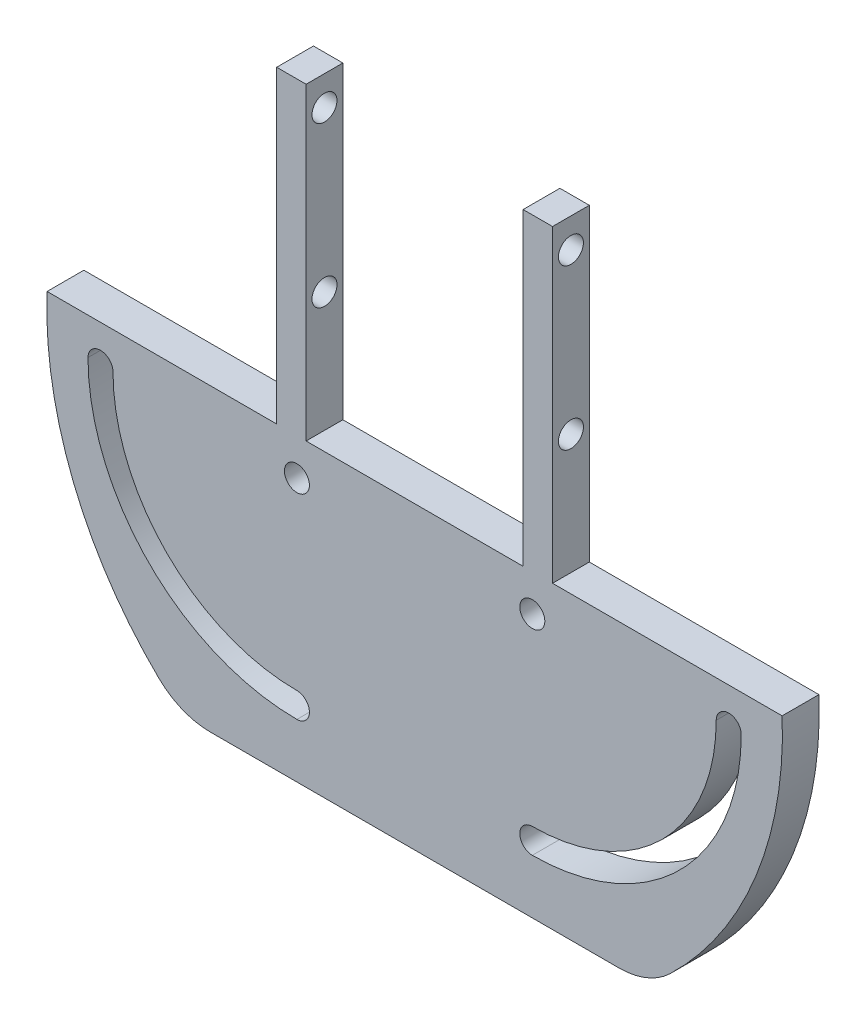
ISO-10303-21;
HEADER;
FILE_DESCRIPTION(('STEP AP214'),'2;1');
FILE_NAME('part.step','',(''),(''),'','','');
FILE_SCHEMA(('AUTOMOTIVE_DESIGN { 1 0 10303 214 1 1 1 1 }'));
ENDSEC;
DATA;
#1=APPLICATION_CONTEXT('core data for automotive mechanical design processes');
#2=APPLICATION_PROTOCOL_DEFINITION('international standard','automotive_design',2000,#1);
#3=PRODUCT_CONTEXT('',#1,'mechanical');
#4=PRODUCT('Part','Part','',(#3));
#5=PRODUCT_RELATED_PRODUCT_CATEGORY('part','',(#4));
#6=PRODUCT_DEFINITION_FORMATION('','',#4);
#7=PRODUCT_DEFINITION_CONTEXT('part definition',#1,'design');
#8=PRODUCT_DEFINITION('design','',#6,#7);
#9=PRODUCT_DEFINITION_SHAPE('','',#8);
#10=(LENGTH_UNIT() NAMED_UNIT(*) SI_UNIT(.MILLI.,.METRE.));
#11=(NAMED_UNIT(*) PLANE_ANGLE_UNIT() SI_UNIT($,.RADIAN.));
#12=(NAMED_UNIT(*) SI_UNIT($,.STERADIAN.) SOLID_ANGLE_UNIT());
#13=UNCERTAINTY_MEASURE_WITH_UNIT(LENGTH_MEASURE(1.E-05),#10,'distance_accuracy_value','');
#14=(GEOMETRIC_REPRESENTATION_CONTEXT(3) GLOBAL_UNCERTAINTY_ASSIGNED_CONTEXT((#13)) GLOBAL_UNIT_ASSIGNED_CONTEXT((#10,
#11,#12)) REPRESENTATION_CONTEXT('',''));
#15=CARTESIAN_POINT('',(0.,0.,0.));
#16=DIRECTION('',(0.,0.,1.));
#17=DIRECTION('',(1.,0.,0.));
#18=AXIS2_PLACEMENT_3D('',#15,#16,#17);
#19=CARTESIAN_POINT('',(-49.9599839871872,2.,-5.));
#20=DIRECTION('',(0.,1.,0.));
#21=DIRECTION('',(0.,0.,1.));
#22=AXIS2_PLACEMENT_3D('',#19,#20,#21);
#23=PLANE('',#22);
#24=DIRECTION('',(-1.,0.,0.));
#25=VECTOR('',#24,1.);
#26=CARTESIAN_POINT('',(-49.9599839871872,2.,-5.));
#27=LINE('',#26,#25);
#28=CARTESIAN_POINT('',(49.9599839871872,2.,-5.));
#29=VERTEX_POINT('',#28);
#30=CARTESIAN_POINT('',(18.75,2.,-5.00000000000001));
#31=VERTEX_POINT('',#30);
#32=EDGE_CURVE('E318',#29,#31,#27,.T.);
#33=ORIENTED_EDGE('',*,*,#32,.T.);
#34=DIRECTION('',(0.,0.,-1.));
#35=VECTOR('',#34,1.);
#36=CARTESIAN_POINT('',(18.75,2.,0.));
#37=LINE('',#36,#35);
#38=CARTESIAN_POINT('',(18.75,2.,0.));
#39=VERTEX_POINT('',#38);
#40=EDGE_CURVE('E506',#39,#31,#37,.T.);
#41=ORIENTED_EDGE('',*,*,#40,.F.);
#42=DIRECTION('',(-1.,0.,0.));
#43=VECTOR('',#42,1.);
#44=CARTESIAN_POINT('',(-49.9599839871872,2.,0.));
#45=LINE('',#44,#43);
#46=CARTESIAN_POINT('',(49.9599839871872,2.,0.));
#47=VERTEX_POINT('',#46);
#48=EDGE_CURVE('E204',#47,#39,#45,.T.);
#49=ORIENTED_EDGE('',*,*,#48,.F.);
#50=DIRECTION('',(0.,0.,1.));
#51=VECTOR('',#50,1.);
#52=CARTESIAN_POINT('',(49.9599839871872,2.,-5.));
#53=LINE('',#52,#51);
#54=EDGE_CURVE('E327',#29,#47,#53,.T.);
#55=ORIENTED_EDGE('',*,*,#54,.F.);
#56=EDGE_LOOP('',(#33,#41,#49,#55));
#57=FACE_BOUND('',#56,.T.);
#58=ADVANCED_FACE('F35',(#57),#23,.T.);
#59=CARTESIAN_POINT('',(14.75,2.,0.));
#60=VERTEX_POINT('',#59);
#61=CARTESIAN_POINT('',(-14.75,2.,0.));
#62=VERTEX_POINT('',#61);
#63=EDGE_CURVE('E332',#60,#62,#45,.T.);
#64=ORIENTED_EDGE('',*,*,#63,.F.);
#65=DIRECTION('',(0.,0.,1.));
#66=VECTOR('',#65,1.);
#67=CARTESIAN_POINT('',(14.75,2.,0.));
#68=LINE('',#67,#66);
#69=CARTESIAN_POINT('',(14.75,2.,-5.00000000000001));
#70=VERTEX_POINT('',#69);
#71=EDGE_CURVE('E199',#70,#60,#68,.T.);
#72=ORIENTED_EDGE('',*,*,#71,.F.);
#73=CARTESIAN_POINT('',(-14.75,2.,-5.));
#74=VERTEX_POINT('',#73);
#75=EDGE_CURVE('E322',#70,#74,#27,.T.);
#76=ORIENTED_EDGE('',*,*,#75,.T.);
#77=DIRECTION('',(0.,0.,-1.));
#78=VECTOR('',#77,1.);
#79=CARTESIAN_POINT('',(-14.75,2.,0.));
#80=LINE('',#79,#78);
#81=EDGE_CURVE('E205',#62,#74,#80,.T.);
#82=ORIENTED_EDGE('',*,*,#81,.F.);
#83=EDGE_LOOP('',(#64,#72,#76,#82));
#84=FACE_BOUND('',#83,.T.);
#85=ADVANCED_FACE('F387',(#84),#23,.T.);
#86=CARTESIAN_POINT('',(0.,0.,-5.));
#87=DIRECTION('',(0.,0.,1.));
#88=DIRECTION('',(1.,0.,0.));
#89=AXIS2_PLACEMENT_3D('',#86,#87,#88);
#90=CYLINDRICAL_SURFACE('',#89,50.);
#91=CARTESIAN_POINT('',(0.,0.,0.));
#92=DIRECTION('',(0.,0.,1.));
#93=DIRECTION('',(-1.,0.,0.));
#94=AXIS2_PLACEMENT_3D('',#91,#92,#93);
#95=CIRCLE('',#94,50.);
#96=CARTESIAN_POINT('',(34.732545986733,-35.967349767247,0.));
#97=VERTEX_POINT('',#96);
#98=EDGE_CURVE('E311',#97,#47,#95,.T.);
#99=ORIENTED_EDGE('',*,*,#98,.F.);
#100=DIRECTION('',(0.,0.,1.));
#101=VECTOR('',#100,1.);
#102=CARTESIAN_POINT('',(34.732545986733,-35.967349767247,-5.));
#103=LINE('',#102,#101);
#104=CARTESIAN_POINT('',(34.732545986733,-35.967349767247,-5.));
#105=VERTEX_POINT('',#104);
#106=EDGE_CURVE('E355',#97,#105,#103,.F.);
#107=ORIENTED_EDGE('',*,*,#106,.T.);
#108=CARTESIAN_POINT('',(0.,0.,-5.));
#109=DIRECTION('',(0.,0.,1.));
#110=DIRECTION('',(-1.,0.,0.));
#111=AXIS2_PLACEMENT_3D('',#108,#109,#110);
#112=CIRCLE('',#111,50.);
#113=EDGE_CURVE('E314',#105,#29,#112,.T.);
#114=ORIENTED_EDGE('',*,*,#113,.T.);
#115=ORIENTED_EDGE('',*,*,#54,.T.);
#116=EDGE_LOOP('',(#99,#107,#114,#115));
#117=FACE_BOUND('',#116,.T.);
#118=ADVANCED_FACE('F393',(#117),#90,.T.);
#119=CARTESIAN_POINT('',(-31.5687542387276,-38.7738798137976,-5.));
#120=DIRECTION('',(0.,-1.,0.));
#121=DIRECTION('',(0.,0.,-1.));
#122=AXIS2_PLACEMENT_3D('',#119,#120,#121);
#123=PLANE('',#122);
#124=DIRECTION('',(1.,0.,0.));
#125=VECTOR('',#124,1.);
#126=CARTESIAN_POINT('',(-31.5687542387276,-38.7738798137976,0.));
#127=LINE('',#126,#125);
#128=CARTESIAN_POINT('',(-27.7860367893864,-38.7738798137976,0.));
#129=VERTEX_POINT('',#128);
#130=CARTESIAN_POINT('',(27.7860367893864,-38.7738798137976,0.));
#131=VERTEX_POINT('',#130);
#132=EDGE_CURVE('E317',#129,#131,#127,.T.);
#133=ORIENTED_EDGE('',*,*,#132,.F.);
#134=DIRECTION('',(0.,0.,1.));
#135=VECTOR('',#134,1.);
#136=CARTESIAN_POINT('',(-27.7860367893864,-38.7738798137976,-5.));
#137=LINE('',#136,#135);
#138=CARTESIAN_POINT('',(-27.7860367893864,-38.7738798137976,-5.));
#139=VERTEX_POINT('',#138);
#140=EDGE_CURVE('E43',#129,#139,#137,.F.);
#141=ORIENTED_EDGE('',*,*,#140,.T.);
#142=DIRECTION('',(1.,0.,0.));
#143=VECTOR('',#142,1.);
#144=CARTESIAN_POINT('',(-31.5687542387276,-38.7738798137976,-5.));
#145=LINE('',#144,#143);
#146=CARTESIAN_POINT('',(27.7860367893864,-38.7738798137976,-5.));
#147=VERTEX_POINT('',#146);
#148=EDGE_CURVE('E325',#139,#147,#145,.T.);
#149=ORIENTED_EDGE('',*,*,#148,.T.);
#150=DIRECTION('',(0.,0.,1.));
#151=VECTOR('',#150,1.);
#152=CARTESIAN_POINT('',(27.7860367893864,-38.7738798137976,-5.));
#153=LINE('',#152,#151);
#154=EDGE_CURVE('E338',#147,#131,#153,.T.);
#155=ORIENTED_EDGE('',*,*,#154,.T.);
#156=EDGE_LOOP('',(#133,#141,#149,#155));
#157=FACE_BOUND('',#156,.T.);
#158=ADVANCED_FACE('F406',(#157),#123,.T.);
#159=CARTESIAN_POINT('',(0.,0.,-5.));
#160=DIRECTION('',(0.,0.,1.));
#161=DIRECTION('',(1.,0.,0.));
#162=AXIS2_PLACEMENT_3D('',#159,#160,#161);
#163=CYLINDRICAL_SURFACE('',#162,50.);
#164=CARTESIAN_POINT('',(0.,0.,-5.));
#165=DIRECTION('',(0.,0.,1.));
#166=DIRECTION('',(-1.,0.,0.));
#167=AXIS2_PLACEMENT_3D('',#164,#165,#166);
#168=CIRCLE('',#167,50.);
#169=CARTESIAN_POINT('',(-49.9599839871872,2.,-5.));
#170=VERTEX_POINT('',#169);
#171=CARTESIAN_POINT('',(-34.732545986733,-35.967349767247,-5.));
#172=VERTEX_POINT('',#171);
#173=EDGE_CURVE('E321',#170,#172,#168,.T.);
#174=ORIENTED_EDGE('',*,*,#173,.T.);
#175=DIRECTION('',(0.,0.,1.));
#176=VECTOR('',#175,1.);
#177=CARTESIAN_POINT('',(-34.732545986733,-35.967349767247,-5.));
#178=LINE('',#177,#176);
#179=CARTESIAN_POINT('',(-34.732545986733,-35.967349767247,0.));
#180=VERTEX_POINT('',#179);
#181=EDGE_CURVE('E360',#172,#180,#178,.T.);
#182=ORIENTED_EDGE('',*,*,#181,.T.);
#183=CARTESIAN_POINT('',(0.,0.,0.));
#184=DIRECTION('',(0.,0.,1.));
#185=DIRECTION('',(-1.,0.,0.));
#186=AXIS2_PLACEMENT_3D('',#183,#184,#185);
#187=CIRCLE('',#186,50.);
#188=CARTESIAN_POINT('',(-49.9599839871872,2.,0.));
#189=VERTEX_POINT('',#188);
#190=EDGE_CURVE('E331',#189,#180,#187,.T.);
#191=ORIENTED_EDGE('',*,*,#190,.F.);
#192=DIRECTION('',(0.,0.,1.));
#193=VECTOR('',#192,1.);
#194=CARTESIAN_POINT('',(-49.9599839871872,2.,-5.));
#195=LINE('',#194,#193);
#196=EDGE_CURVE('E335',#170,#189,#195,.T.);
#197=ORIENTED_EDGE('',*,*,#196,.F.);
#198=EDGE_LOOP('',(#174,#182,#191,#197));
#199=FACE_BOUND('',#198,.T.);
#200=ADVANCED_FACE('F366',(#199),#163,.T.);
#201=DIRECTION('',(0.,0.,1.));
#202=VECTOR('',#201,1.);
#203=CARTESIAN_POINT('',(-18.75,2.,0.));
#204=LINE('',#203,#202);
#205=CARTESIAN_POINT('',(-18.75,2.,-5.));
#206=VERTEX_POINT('',#205);
#207=CARTESIAN_POINT('',(-18.75,2.,0.));
#208=VERTEX_POINT('',#207);
#209=EDGE_CURVE('E208',#206,#208,#204,.T.);
#210=ORIENTED_EDGE('',*,*,#209,.F.);
#211=EDGE_CURVE('E316',#206,#170,#27,.T.);
#212=ORIENTED_EDGE('',*,*,#211,.T.);
#213=ORIENTED_EDGE('',*,*,#196,.T.);
#214=EDGE_CURVE('E329',#208,#189,#45,.T.);
#215=ORIENTED_EDGE('',*,*,#214,.F.);
#216=EDGE_LOOP('',(#210,#212,#213,#215));
#217=FACE_BOUND('',#216,.T.);
#218=ADVANCED_FACE('F374',(#217),#23,.T.);
#219=CARTESIAN_POINT('',(0.,0.,-5.));
#220=DIRECTION('',(0.,0.,-1.));
#221=DIRECTION('',(-1.,0.,0.));
#222=AXIS2_PLACEMENT_3D('',#219,#220,#221);
#223=PLANE('',#222);
#224=CARTESIAN_POINT('',(16.,-29.7,-5.));
#225=DIRECTION('',(0.,0.,1.));
#226=DIRECTION('',(1.,0.,0.));
#227=AXIS2_PLACEMENT_3D('',#224,#225,#226);
#228=CIRCLE('',#227,1.7);
#229=CARTESIAN_POINT('',(16.,-28.,-5.));
#230=VERTEX_POINT('',#229);
#231=CARTESIAN_POINT('',(16.,-31.4,-5.));
#232=VERTEX_POINT('',#231);
#233=EDGE_CURVE('E238',#230,#232,#228,.T.);
#234=ORIENTED_EDGE('',*,*,#233,.T.);
#235=CARTESIAN_POINT('',(16.,-3.,-5.));
#236=DIRECTION('',(0.,0.,1.));
#237=DIRECTION('',(1.,0.,0.));
#238=AXIS2_PLACEMENT_3D('',#235,#236,#237);
#239=CIRCLE('',#238,28.4);
#240=CARTESIAN_POINT('',(44.4,-3.,-5.));
#241=VERTEX_POINT('',#240);
#242=EDGE_CURVE('E241',#232,#241,#239,.T.);
#243=ORIENTED_EDGE('',*,*,#242,.T.);
#244=CARTESIAN_POINT('',(42.7,-3.00000000000001,-5.));
#245=DIRECTION('',(0.,0.,1.));
#246=DIRECTION('',(1.,0.,0.));
#247=AXIS2_PLACEMENT_3D('',#244,#245,#246);
#248=CIRCLE('',#247,1.7);
#249=CARTESIAN_POINT('',(41.,-3.00000000000001,-5.));
#250=VERTEX_POINT('',#249);
#251=EDGE_CURVE('E245',#241,#250,#248,.T.);
#252=ORIENTED_EDGE('',*,*,#251,.T.);
#253=CARTESIAN_POINT('',(16.,-3.,-5.));
#254=DIRECTION('',(0.,0.,-1.));
#255=DIRECTION('',(1.,0.,0.));
#256=AXIS2_PLACEMENT_3D('',#253,#254,#255);
#257=CIRCLE('',#256,25.);
#258=EDGE_CURVE('E248',#250,#230,#257,.T.);
#259=ORIENTED_EDGE('',*,*,#258,.T.);
#260=EDGE_LOOP('',(#234,#243,#252,#259));
#261=FACE_BOUND('',#260,.T.);
#262=CARTESIAN_POINT('',(-42.7,-3.,-5.));
#263=DIRECTION('',(0.,0.,1.));
#264=DIRECTION('',(1.,0.,0.));
#265=AXIS2_PLACEMENT_3D('',#262,#263,#264);
#266=CIRCLE('',#265,1.7);
#267=CARTESIAN_POINT('',(-41.,-3.,-5.));
#268=VERTEX_POINT('',#267);
#269=CARTESIAN_POINT('',(-44.4,-3.,-5.));
#270=VERTEX_POINT('',#269);
#271=EDGE_CURVE('E270',#268,#270,#266,.T.);
#272=ORIENTED_EDGE('',*,*,#271,.T.);
#273=CARTESIAN_POINT('',(-16.,-3.,-5.));
#274=DIRECTION('',(0.,0.,1.));
#275=DIRECTION('',(1.,0.,0.));
#276=AXIS2_PLACEMENT_3D('',#273,#274,#275);
#277=CIRCLE('',#276,28.4);
#278=CARTESIAN_POINT('',(-16.,-31.4,-5.));
#279=VERTEX_POINT('',#278);
#280=EDGE_CURVE('E273',#270,#279,#277,.T.);
#281=ORIENTED_EDGE('',*,*,#280,.T.);
#282=CARTESIAN_POINT('',(-16.,-29.7,-5.));
#283=DIRECTION('',(0.,0.,1.));
#284=DIRECTION('',(1.,0.,0.));
#285=AXIS2_PLACEMENT_3D('',#282,#283,#284);
#286=CIRCLE('',#285,1.7);
#287=CARTESIAN_POINT('',(-16.,-28.,-5.));
#288=VERTEX_POINT('',#287);
#289=EDGE_CURVE('E277',#279,#288,#286,.T.);
#290=ORIENTED_EDGE('',*,*,#289,.T.);
#291=CARTESIAN_POINT('',(-16.,-3.,-5.));
#292=DIRECTION('',(0.,0.,-1.));
#293=DIRECTION('',(1.,0.,0.));
#294=AXIS2_PLACEMENT_3D('',#291,#292,#293);
#295=CIRCLE('',#294,25.);
#296=EDGE_CURVE('E280',#288,#268,#295,.T.);
#297=ORIENTED_EDGE('',*,*,#296,.T.);
#298=EDGE_LOOP('',(#272,#281,#290,#297));
#299=FACE_BOUND('',#298,.T.);
#300=CARTESIAN_POINT('',(16.,-3.,-5.));
#301=DIRECTION('',(0.,0.,1.));
#302=DIRECTION('',(1.,0.,0.));
#303=AXIS2_PLACEMENT_3D('',#300,#301,#302);
#304=CIRCLE('',#303,1.7);
#305=CARTESIAN_POINT('',(17.7,-3.,-5.));
#306=VERTEX_POINT('',#305);
#307=EDGE_CURVE('E302',#306,#306,#304,.T.);
#308=ORIENTED_EDGE('',*,*,#307,.T.);
#309=EDGE_LOOP('',(#308));
#310=FACE_BOUND('',#309,.T.);
#311=CARTESIAN_POINT('',(-16.,-3.,-5.));
#312=DIRECTION('',(0.,0.,1.));
#313=DIRECTION('',(1.,0.,0.));
#314=AXIS2_PLACEMENT_3D('',#311,#312,#313);
#315=CIRCLE('',#314,1.7);
#316=CARTESIAN_POINT('',(-14.3,-3.,-5.));
#317=VERTEX_POINT('',#316);
#318=EDGE_CURVE('E308',#317,#317,#315,.T.);
#319=ORIENTED_EDGE('',*,*,#318,.T.);
#320=EDGE_LOOP('',(#319));
#321=FACE_BOUND('',#320,.T.);
#322=ORIENTED_EDGE('',*,*,#148,.F.);
#323=CARTESIAN_POINT('',(-27.7860367893864,-28.7738798137976,-5.));
#324=DIRECTION('',(0.,0.,-1.));
#325=DIRECTION('',(-1.,0.,0.));
#326=AXIS2_PLACEMENT_3D('',#323,#324,#325);
#327=CIRCLE('',#326,10.);
#328=EDGE_CURVE('E11',#139,#172,#327,.T.);
#329=ORIENTED_EDGE('',*,*,#328,.T.);
#330=ORIENTED_EDGE('',*,*,#173,.F.);
#331=ORIENTED_EDGE('',*,*,#211,.F.);
#332=DIRECTION('',(0.,-1.,0.));
#333=VECTOR('',#332,1.);
#334=CARTESIAN_POINT('',(-18.75,44.,-5.00000000000001));
#335=LINE('',#334,#333);
#336=CARTESIAN_POINT('',(-18.75,44.,-5.00000000000001));
#337=VERTEX_POINT('',#336);
#338=EDGE_CURVE('E231',#337,#206,#335,.T.);
#339=ORIENTED_EDGE('',*,*,#338,.F.);
#340=DIRECTION('',(-1.,0.,0.));
#341=VECTOR('',#340,1.);
#342=CARTESIAN_POINT('',(-14.75,44.,-5.00000000000001));
#343=LINE('',#342,#341);
#344=CARTESIAN_POINT('',(-14.75,44.,-5.00000000000001));
#345=VERTEX_POINT('',#344);
#346=EDGE_CURVE('E217',#345,#337,#343,.T.);
#347=ORIENTED_EDGE('',*,*,#346,.F.);
#348=DIRECTION('',(0.,-1.,0.));
#349=VECTOR('',#348,1.);
#350=CARTESIAN_POINT('',(-14.75,44.,-5.00000000000001));
#351=LINE('',#350,#349);
#352=EDGE_CURVE('E234',#345,#74,#351,.T.);
#353=ORIENTED_EDGE('',*,*,#352,.T.);
#354=ORIENTED_EDGE('',*,*,#75,.F.);
#355=DIRECTION('',(0.,-1.,0.));
#356=VECTOR('',#355,1.);
#357=CARTESIAN_POINT('',(14.75,44.,-5.00000000000001));
#358=LINE('',#357,#356);
#359=CARTESIAN_POINT('',(14.75,44.,-5.00000000000001));
#360=VERTEX_POINT('',#359);
#361=EDGE_CURVE('E210',#360,#70,#358,.T.);
#362=ORIENTED_EDGE('',*,*,#361,.F.);
#363=DIRECTION('',(-1.,0.,0.));
#364=VECTOR('',#363,1.);
#365=CARTESIAN_POINT('',(14.75,44.,-5.00000000000001));
#366=LINE('',#365,#364);
#367=CARTESIAN_POINT('',(18.75,44.,-5.00000000000001));
#368=VERTEX_POINT('',#367);
#369=EDGE_CURVE('E191',#368,#360,#366,.T.);
#370=ORIENTED_EDGE('',*,*,#369,.F.);
#371=DIRECTION('',(0.,-1.,0.));
#372=VECTOR('',#371,1.);
#373=CARTESIAN_POINT('',(18.75,44.,-5.00000000000001));
#374=LINE('',#373,#372);
#375=EDGE_CURVE('E188',#368,#31,#374,.T.);
#376=ORIENTED_EDGE('',*,*,#375,.T.);
#377=ORIENTED_EDGE('',*,*,#32,.F.);
#378=ORIENTED_EDGE('',*,*,#113,.F.);
#379=CARTESIAN_POINT('',(27.7860367893864,-28.7738798137976,-5.));
#380=DIRECTION('',(0.,0.,-1.));
#381=DIRECTION('',(-1.,0.,0.));
#382=AXIS2_PLACEMENT_3D('',#379,#380,#381);
#383=CIRCLE('',#382,10.);
#384=EDGE_CURVE('E357',#105,#147,#383,.T.);
#385=ORIENTED_EDGE('',*,*,#384,.T.);
#386=EDGE_LOOP('',(#322,#329,#330,#331,#339,#347,#353,#354,#362,#370,#376,#377,#378,#385));
#387=FACE_BOUND('',#386,.T.);
#388=ADVANCED_FACE('F377',(#261,#299,#310,#321,#387),#223,.T.);
#389=CARTESIAN_POINT('',(0.,0.,0.));
#390=DIRECTION('',(0.,0.,-1.));
#391=DIRECTION('',(-1.,0.,0.));
#392=AXIS2_PLACEMENT_3D('',#389,#390,#391);
#393=PLANE('',#392);
#394=CARTESIAN_POINT('',(16.,-3.,0.));
#395=DIRECTION('',(0.,0.,1.));
#396=DIRECTION('',(1.,0.,0.));
#397=AXIS2_PLACEMENT_3D('',#394,#395,#396);
#398=CIRCLE('',#397,28.4);
#399=CARTESIAN_POINT('',(16.,-31.4,0.));
#400=VERTEX_POINT('',#399);
#401=CARTESIAN_POINT('',(44.4,-3.,0.));
#402=VERTEX_POINT('',#401);
#403=EDGE_CURVE('E253',#400,#402,#398,.T.);
#404=ORIENTED_EDGE('',*,*,#403,.F.);
#405=CARTESIAN_POINT('',(16.,-29.7,0.));
#406=DIRECTION('',(0.,0.,1.));
#407=DIRECTION('',(1.,0.,0.));
#408=AXIS2_PLACEMENT_3D('',#405,#406,#407);
#409=CIRCLE('',#408,1.7);
#410=CARTESIAN_POINT('',(16.,-28.,0.));
#411=VERTEX_POINT('',#410);
#412=EDGE_CURVE('E237',#411,#400,#409,.T.);
#413=ORIENTED_EDGE('',*,*,#412,.F.);
#414=CARTESIAN_POINT('',(16.,-3.,0.));
#415=DIRECTION('',(0.,0.,-1.));
#416=DIRECTION('',(1.,0.,0.));
#417=AXIS2_PLACEMENT_3D('',#414,#415,#416);
#418=CIRCLE('',#417,25.);
#419=CARTESIAN_POINT('',(41.,-3.00000000000001,0.));
#420=VERTEX_POINT('',#419);
#421=EDGE_CURVE('E242',#420,#411,#418,.T.);
#422=ORIENTED_EDGE('',*,*,#421,.F.);
#423=CARTESIAN_POINT('',(42.7,-3.00000000000001,0.));
#424=DIRECTION('',(0.,0.,1.));
#425=DIRECTION('',(1.,0.,0.));
#426=AXIS2_PLACEMENT_3D('',#423,#424,#425);
#427=CIRCLE('',#426,1.7);
#428=EDGE_CURVE('E256',#402,#420,#427,.T.);
#429=ORIENTED_EDGE('',*,*,#428,.F.);
#430=EDGE_LOOP('',(#404,#413,#422,#429));
#431=FACE_BOUND('',#430,.T.);
#432=CARTESIAN_POINT('',(-16.,-3.,0.));
#433=DIRECTION('',(0.,0.,1.));
#434=DIRECTION('',(1.,0.,0.));
#435=AXIS2_PLACEMENT_3D('',#432,#433,#434);
#436=CIRCLE('',#435,28.4);
#437=CARTESIAN_POINT('',(-44.4,-3.,0.));
#438=VERTEX_POINT('',#437);
#439=CARTESIAN_POINT('',(-16.,-31.4,0.));
#440=VERTEX_POINT('',#439);
#441=EDGE_CURVE('E285',#438,#440,#436,.T.);
#442=ORIENTED_EDGE('',*,*,#441,.F.);
#443=CARTESIAN_POINT('',(-42.7,-3.,0.));
#444=DIRECTION('',(0.,0.,1.));
#445=DIRECTION('',(1.,0.,0.));
#446=AXIS2_PLACEMENT_3D('',#443,#444,#445);
#447=CIRCLE('',#446,1.7);
#448=CARTESIAN_POINT('',(-41.,-3.,0.));
#449=VERTEX_POINT('',#448);
#450=EDGE_CURVE('E263',#449,#438,#447,.T.);
#451=ORIENTED_EDGE('',*,*,#450,.F.);
#452=CARTESIAN_POINT('',(-16.,-3.,0.));
#453=DIRECTION('',(0.,0.,-1.));
#454=DIRECTION('',(1.,0.,0.));
#455=AXIS2_PLACEMENT_3D('',#452,#453,#454);
#456=CIRCLE('',#455,25.);
#457=CARTESIAN_POINT('',(-16.,-28.,0.));
#458=VERTEX_POINT('',#457);
#459=EDGE_CURVE('E274',#458,#449,#456,.T.);
#460=ORIENTED_EDGE('',*,*,#459,.F.);
#461=CARTESIAN_POINT('',(-16.,-29.7,0.));
#462=DIRECTION('',(0.,0.,1.));
#463=DIRECTION('',(1.,0.,0.));
#464=AXIS2_PLACEMENT_3D('',#461,#462,#463);
#465=CIRCLE('',#464,1.7);
#466=EDGE_CURVE('E288',#440,#458,#465,.T.);
#467=ORIENTED_EDGE('',*,*,#466,.F.);
#468=EDGE_LOOP('',(#442,#451,#460,#467));
#469=FACE_BOUND('',#468,.T.);
#470=CARTESIAN_POINT('',(16.,-3.,0.));
#471=DIRECTION('',(0.,0.,1.));
#472=DIRECTION('',(1.,0.,0.));
#473=AXIS2_PLACEMENT_3D('',#470,#471,#472);
#474=CIRCLE('',#473,1.7);
#475=CARTESIAN_POINT('',(17.7,-3.,0.));
#476=VERTEX_POINT('',#475);
#477=EDGE_CURVE('E295',#476,#476,#474,.T.);
#478=ORIENTED_EDGE('',*,*,#477,.F.);
#479=EDGE_LOOP('',(#478));
#480=FACE_BOUND('',#479,.T.);
#481=CARTESIAN_POINT('',(-16.,-3.,0.));
#482=DIRECTION('',(0.,0.,1.));
#483=DIRECTION('',(1.,0.,0.));
#484=AXIS2_PLACEMENT_3D('',#481,#482,#483);
#485=CIRCLE('',#484,1.7);
#486=CARTESIAN_POINT('',(-14.3,-3.,0.));
#487=VERTEX_POINT('',#486);
#488=EDGE_CURVE('E305',#487,#487,#485,.T.);
#489=ORIENTED_EDGE('',*,*,#488,.F.);
#490=EDGE_LOOP('',(#489));
#491=FACE_BOUND('',#490,.T.);
#492=ORIENTED_EDGE('',*,*,#190,.T.);
#493=CARTESIAN_POINT('',(-27.7860367893864,-28.7738798137976,0.));
#494=DIRECTION('',(0.,0.,-1.));
#495=DIRECTION('',(-1.,0.,0.));
#496=AXIS2_PLACEMENT_3D('',#493,#494,#495);
#497=CIRCLE('',#496,10.);
#498=EDGE_CURVE('E57',#180,#129,#497,.F.);
#499=ORIENTED_EDGE('',*,*,#498,.T.);
#500=ORIENTED_EDGE('',*,*,#132,.T.);
#501=CARTESIAN_POINT('',(27.7860367893864,-28.7738798137976,0.));
#502=DIRECTION('',(0.,0.,-1.));
#503=DIRECTION('',(-1.,0.,0.));
#504=AXIS2_PLACEMENT_3D('',#501,#502,#503);
#505=CIRCLE('',#504,10.);
#506=EDGE_CURVE('E353',#131,#97,#505,.F.);
#507=ORIENTED_EDGE('',*,*,#506,.T.);
#508=ORIENTED_EDGE('',*,*,#98,.T.);
#509=ORIENTED_EDGE('',*,*,#48,.T.);
#510=DIRECTION('',(0.,-1.,0.));
#511=VECTOR('',#510,1.);
#512=CARTESIAN_POINT('',(18.75,44.,0.));
#513=LINE('',#512,#511);
#514=CARTESIAN_POINT('',(18.75,44.,0.));
#515=VERTEX_POINT('',#514);
#516=EDGE_CURVE('E185',#515,#39,#513,.T.);
#517=ORIENTED_EDGE('',*,*,#516,.F.);
#518=DIRECTION('',(1.,0.,0.));
#519=VECTOR('',#518,1.);
#520=CARTESIAN_POINT('',(14.75,44.,0.));
#521=LINE('',#520,#519);
#522=CARTESIAN_POINT('',(14.75,44.,0.));
#523=VERTEX_POINT('',#522);
#524=EDGE_CURVE('E192',#523,#515,#521,.T.);
#525=ORIENTED_EDGE('',*,*,#524,.F.);
#526=DIRECTION('',(0.,-1.,0.));
#527=VECTOR('',#526,1.);
#528=CARTESIAN_POINT('',(14.75,44.,0.));
#529=LINE('',#528,#527);
#530=EDGE_CURVE('E503',#523,#60,#529,.T.);
#531=ORIENTED_EDGE('',*,*,#530,.T.);
#532=ORIENTED_EDGE('',*,*,#63,.T.);
#533=DIRECTION('',(0.,-1.,0.));
#534=VECTOR('',#533,1.);
#535=CARTESIAN_POINT('',(-14.75,44.,0.));
#536=LINE('',#535,#534);
#537=CARTESIAN_POINT('',(-14.75,44.,0.));
#538=VERTEX_POINT('',#537);
#539=EDGE_CURVE('E222',#538,#62,#536,.T.);
#540=ORIENTED_EDGE('',*,*,#539,.F.);
#541=DIRECTION('',(1.,0.,0.));
#542=VECTOR('',#541,1.);
#543=CARTESIAN_POINT('',(-14.75,44.,0.));
#544=LINE('',#543,#542);
#545=CARTESIAN_POINT('',(-18.75,44.,0.));
#546=VERTEX_POINT('',#545);
#547=EDGE_CURVE('E221',#546,#538,#544,.T.);
#548=ORIENTED_EDGE('',*,*,#547,.F.);
#549=DIRECTION('',(0.,-1.,0.));
#550=VECTOR('',#549,1.);
#551=CARTESIAN_POINT('',(-18.75,44.,0.));
#552=LINE('',#551,#550);
#553=EDGE_CURVE('E228',#546,#208,#552,.T.);
#554=ORIENTED_EDGE('',*,*,#553,.T.);
#555=ORIENTED_EDGE('',*,*,#214,.T.);
#556=EDGE_LOOP('',(#492,#499,#500,#507,#508,#509,#517,#525,#531,#532,#540,#548,#554,#555));
#557=FACE_BOUND('',#556,.T.);
#558=ADVANCED_FACE('F202',(#431,#469,#480,#491,#557),#393,.F.);
#559=CARTESIAN_POINT('',(-16.,-3.,-5.));
#560=DIRECTION('',(0.,0.,1.));
#561=DIRECTION('',(1.,0.,0.));
#562=AXIS2_PLACEMENT_3D('',#559,#560,#561);
#563=CYLINDRICAL_SURFACE('',#562,1.7);
#564=ORIENTED_EDGE('',*,*,#318,.F.);
#565=EDGE_LOOP('',(#564));
#566=FACE_BOUND('',#565,.T.);
#567=ORIENTED_EDGE('',*,*,#488,.T.);
#568=EDGE_LOOP('',(#567));
#569=FACE_BOUND('',#568,.T.);
#570=ADVANCED_FACE('F412',(#566,#569),#563,.F.);
#571=CARTESIAN_POINT('',(16.,-3.,-5.));
#572=DIRECTION('',(0.,0.,1.));
#573=DIRECTION('',(1.,0.,0.));
#574=AXIS2_PLACEMENT_3D('',#571,#572,#573);
#575=CYLINDRICAL_SURFACE('',#574,1.7);
#576=ORIENTED_EDGE('',*,*,#307,.F.);
#577=EDGE_LOOP('',(#576));
#578=FACE_BOUND('',#577,.T.);
#579=ORIENTED_EDGE('',*,*,#477,.T.);
#580=EDGE_LOOP('',(#579));
#581=FACE_BOUND('',#580,.T.);
#582=ADVANCED_FACE('F417',(#578,#581),#575,.F.);
#583=CARTESIAN_POINT('',(-42.7,-3.,-5.));
#584=DIRECTION('',(0.,0.,1.));
#585=DIRECTION('',(1.,0.,0.));
#586=AXIS2_PLACEMENT_3D('',#583,#584,#585);
#587=CYLINDRICAL_SURFACE('',#586,1.7);
#588=ORIENTED_EDGE('',*,*,#450,.T.);
#589=DIRECTION('',(0.,0.,1.));
#590=VECTOR('',#589,1.);
#591=CARTESIAN_POINT('',(-44.4,-3.,-5.));
#592=LINE('',#591,#590);
#593=EDGE_CURVE('E283',#270,#438,#592,.T.);
#594=ORIENTED_EDGE('',*,*,#593,.F.);
#595=ORIENTED_EDGE('',*,*,#271,.F.);
#596=DIRECTION('',(0.,0.,1.));
#597=VECTOR('',#596,1.);
#598=CARTESIAN_POINT('',(-41.,-3.,-5.));
#599=LINE('',#598,#597);
#600=EDGE_CURVE('E293',#268,#449,#599,.T.);
#601=ORIENTED_EDGE('',*,*,#600,.T.);
#602=EDGE_LOOP('',(#588,#594,#595,#601));
#603=FACE_BOUND('',#602,.T.);
#604=ADVANCED_FACE('F421',(#603),#587,.F.);
#605=CARTESIAN_POINT('',(-16.,-3.,-5.));
#606=DIRECTION('',(0.,0.,1.));
#607=DIRECTION('',(1.,0.,0.));
#608=AXIS2_PLACEMENT_3D('',#605,#606,#607);
#609=CYLINDRICAL_SURFACE('',#608,25.);
#610=ORIENTED_EDGE('',*,*,#459,.T.);
#611=ORIENTED_EDGE('',*,*,#600,.F.);
#612=ORIENTED_EDGE('',*,*,#296,.F.);
#613=DIRECTION('',(0.,0.,1.));
#614=VECTOR('',#613,1.);
#615=CARTESIAN_POINT('',(-16.,-28.,-5.));
#616=LINE('',#615,#614);
#617=EDGE_CURVE('E296',#288,#458,#616,.T.);
#618=ORIENTED_EDGE('',*,*,#617,.T.);
#619=EDGE_LOOP('',(#610,#611,#612,#618));
#620=FACE_BOUND('',#619,.T.);
#621=ADVANCED_FACE('F425',(#620),#609,.T.);
#622=CARTESIAN_POINT('',(-16.,-29.7,-5.));
#623=DIRECTION('',(0.,0.,1.));
#624=DIRECTION('',(1.,0.,0.));
#625=AXIS2_PLACEMENT_3D('',#622,#623,#624);
#626=CYLINDRICAL_SURFACE('',#625,1.7);
#627=ORIENTED_EDGE('',*,*,#466,.T.);
#628=ORIENTED_EDGE('',*,*,#617,.F.);
#629=ORIENTED_EDGE('',*,*,#289,.F.);
#630=DIRECTION('',(0.,0.,1.));
#631=VECTOR('',#630,1.);
#632=CARTESIAN_POINT('',(-16.,-31.4,-5.));
#633=LINE('',#632,#631);
#634=EDGE_CURVE('E298',#279,#440,#633,.T.);
#635=ORIENTED_EDGE('',*,*,#634,.T.);
#636=EDGE_LOOP('',(#627,#628,#629,#635));
#637=FACE_BOUND('',#636,.T.);
#638=ADVANCED_FACE('F431',(#637),#626,.F.);
#639=CARTESIAN_POINT('',(-16.,-3.,-5.));
#640=DIRECTION('',(0.,0.,1.));
#641=DIRECTION('',(1.,0.,0.));
#642=AXIS2_PLACEMENT_3D('',#639,#640,#641);
#643=CYLINDRICAL_SURFACE('',#642,28.4);
#644=ORIENTED_EDGE('',*,*,#441,.T.);
#645=ORIENTED_EDGE('',*,*,#634,.F.);
#646=ORIENTED_EDGE('',*,*,#280,.F.);
#647=ORIENTED_EDGE('',*,*,#593,.T.);
#648=EDGE_LOOP('',(#644,#645,#646,#647));
#649=FACE_BOUND('',#648,.T.);
#650=ADVANCED_FACE('F427',(#649),#643,.F.);
#651=CARTESIAN_POINT('',(16.,-29.7,-5.));
#652=DIRECTION('',(0.,0.,1.));
#653=DIRECTION('',(1.,0.,0.));
#654=AXIS2_PLACEMENT_3D('',#651,#652,#653);
#655=CYLINDRICAL_SURFACE('',#654,1.7);
#656=ORIENTED_EDGE('',*,*,#412,.T.);
#657=DIRECTION('',(0.,0.,1.));
#658=VECTOR('',#657,1.);
#659=CARTESIAN_POINT('',(16.,-31.4,-5.));
#660=LINE('',#659,#658);
#661=EDGE_CURVE('E251',#232,#400,#660,.T.);
#662=ORIENTED_EDGE('',*,*,#661,.F.);
#663=ORIENTED_EDGE('',*,*,#233,.F.);
#664=DIRECTION('',(0.,0.,1.));
#665=VECTOR('',#664,1.);
#666=CARTESIAN_POINT('',(16.,-28.,-5.));
#667=LINE('',#666,#665);
#668=EDGE_CURVE('E261',#230,#411,#667,.T.);
#669=ORIENTED_EDGE('',*,*,#668,.T.);
#670=EDGE_LOOP('',(#656,#662,#663,#669));
#671=FACE_BOUND('',#670,.T.);
#672=ADVANCED_FACE('F430',(#671),#655,.F.);
#673=CARTESIAN_POINT('',(16.,-3.,-5.));
#674=DIRECTION('',(0.,0.,1.));
#675=DIRECTION('',(1.,0.,0.));
#676=AXIS2_PLACEMENT_3D('',#673,#674,#675);
#677=CYLINDRICAL_SURFACE('',#676,25.);
#678=ORIENTED_EDGE('',*,*,#421,.T.);
#679=ORIENTED_EDGE('',*,*,#668,.F.);
#680=ORIENTED_EDGE('',*,*,#258,.F.);
#681=DIRECTION('',(0.,0.,1.));
#682=VECTOR('',#681,1.);
#683=CARTESIAN_POINT('',(41.,-3.00000000000001,-5.));
#684=LINE('',#683,#682);
#685=EDGE_CURVE('E264',#250,#420,#684,.T.);
#686=ORIENTED_EDGE('',*,*,#685,.T.);
#687=EDGE_LOOP('',(#678,#679,#680,#686));
#688=FACE_BOUND('',#687,.T.);
#689=ADVANCED_FACE('F441',(#688),#677,.T.);
#690=CARTESIAN_POINT('',(42.7,-3.00000000000001,-5.));
#691=DIRECTION('',(0.,0.,1.));
#692=DIRECTION('',(1.,0.,0.));
#693=AXIS2_PLACEMENT_3D('',#690,#691,#692);
#694=CYLINDRICAL_SURFACE('',#693,1.7);
#695=ORIENTED_EDGE('',*,*,#428,.T.);
#696=ORIENTED_EDGE('',*,*,#685,.F.);
#697=ORIENTED_EDGE('',*,*,#251,.F.);
#698=DIRECTION('',(0.,0.,1.));
#699=VECTOR('',#698,1.);
#700=CARTESIAN_POINT('',(44.4,-3.,-5.));
#701=LINE('',#700,#699);
#702=EDGE_CURVE('E266',#241,#402,#701,.T.);
#703=ORIENTED_EDGE('',*,*,#702,.T.);
#704=EDGE_LOOP('',(#695,#696,#697,#703));
#705=FACE_BOUND('',#704,.T.);
#706=ADVANCED_FACE('F447',(#705),#694,.F.);
#707=CARTESIAN_POINT('',(16.,-3.,-5.));
#708=DIRECTION('',(0.,0.,1.));
#709=DIRECTION('',(1.,0.,0.));
#710=AXIS2_PLACEMENT_3D('',#707,#708,#709);
#711=CYLINDRICAL_SURFACE('',#710,28.4);
#712=ORIENTED_EDGE('',*,*,#403,.T.);
#713=ORIENTED_EDGE('',*,*,#702,.F.);
#714=ORIENTED_EDGE('',*,*,#242,.F.);
#715=ORIENTED_EDGE('',*,*,#661,.T.);
#716=EDGE_LOOP('',(#712,#713,#714,#715));
#717=FACE_BOUND('',#716,.T.);
#718=ADVANCED_FACE('F443',(#717),#711,.F.);
#719=CARTESIAN_POINT('',(-14.75,44.,0.));
#720=DIRECTION('',(-1.,0.,0.));
#721=DIRECTION('',(0.,0.,1.));
#722=AXIS2_PLACEMENT_3D('',#719,#720,#721);
#723=PLANE('',#722);
#724=CARTESIAN_POINT('',(-14.75,40.,-2.49999999999999));
#725=DIRECTION('',(-1.,0.,0.));
#726=DIRECTION('',(0.,0.,1.));
#727=AXIS2_PLACEMENT_3D('',#724,#725,#726);
#728=CIRCLE('',#727,1.7);
#729=CARTESIAN_POINT('',(-14.75,40.,-0.799999999999991));
#730=VERTEX_POINT('',#729);
#731=EDGE_CURVE('E514',#730,#730,#728,.T.);
#732=ORIENTED_EDGE('',*,*,#731,.T.);
#733=EDGE_LOOP('',(#732));
#734=FACE_BOUND('',#733,.T.);
#735=CARTESIAN_POINT('',(-14.75,18.3,-2.5));
#736=DIRECTION('',(-1.,0.,0.));
#737=DIRECTION('',(0.,0.,1.));
#738=AXIS2_PLACEMENT_3D('',#735,#736,#737);
#739=CIRCLE('',#738,1.7);
#740=CARTESIAN_POINT('',(-14.75,18.3,-0.799999999999995));
#741=VERTEX_POINT('',#740);
#742=EDGE_CURVE('E350',#741,#741,#739,.T.);
#743=ORIENTED_EDGE('',*,*,#742,.T.);
#744=EDGE_LOOP('',(#743));
#745=FACE_BOUND('',#744,.T.);
#746=ORIENTED_EDGE('',*,*,#81,.T.);
#747=ORIENTED_EDGE('',*,*,#352,.F.);
#748=DIRECTION('',(0.,0.,-1.));
#749=VECTOR('',#748,1.);
#750=CARTESIAN_POINT('',(-14.75,44.,0.));
#751=LINE('',#750,#749);
#752=EDGE_CURVE('E214',#538,#345,#751,.T.);
#753=ORIENTED_EDGE('',*,*,#752,.F.);
#754=ORIENTED_EDGE('',*,*,#539,.T.);
#755=EDGE_LOOP('',(#746,#747,#753,#754));
#756=FACE_BOUND('',#755,.T.);
#757=ADVANCED_FACE('F446',(#734,#745,#756),#723,.F.);
#758=CARTESIAN_POINT('',(-18.75,44.,0.));
#759=DIRECTION('',(1.,0.,0.));
#760=DIRECTION('',(0.,0.,-1.));
#761=AXIS2_PLACEMENT_3D('',#758,#759,#760);
#762=PLANE('',#761);
#763=CARTESIAN_POINT('',(-18.75,40.,-2.49999999999999));
#764=DIRECTION('',(1.,0.,0.));
#765=DIRECTION('',(0.,0.,-1.));
#766=AXIS2_PLACEMENT_3D('',#763,#764,#765);
#767=CIRCLE('',#766,1.7);
#768=CARTESIAN_POINT('',(-18.75,40.,-4.19999999999999));
#769=VERTEX_POINT('',#768);
#770=EDGE_CURVE('E349',#769,#769,#767,.T.);
#771=ORIENTED_EDGE('',*,*,#770,.T.);
#772=EDGE_LOOP('',(#771));
#773=FACE_BOUND('',#772,.T.);
#774=CARTESIAN_POINT('',(-18.75,18.3,-2.5));
#775=DIRECTION('',(1.,0.,0.));
#776=DIRECTION('',(0.,0.,-1.));
#777=AXIS2_PLACEMENT_3D('',#774,#775,#776);
#778=CIRCLE('',#777,1.7);
#779=CARTESIAN_POINT('',(-18.75,18.3,-4.2));
#780=VERTEX_POINT('',#779);
#781=EDGE_CURVE('E344',#780,#780,#778,.T.);
#782=ORIENTED_EDGE('',*,*,#781,.T.);
#783=EDGE_LOOP('',(#782));
#784=FACE_BOUND('',#783,.T.);
#785=ORIENTED_EDGE('',*,*,#209,.T.);
#786=ORIENTED_EDGE('',*,*,#553,.F.);
#787=DIRECTION('',(0.,0.,1.));
#788=VECTOR('',#787,1.);
#789=CARTESIAN_POINT('',(-18.75,44.,0.));
#790=LINE('',#789,#788);
#791=EDGE_CURVE('E219',#337,#546,#790,.T.);
#792=ORIENTED_EDGE('',*,*,#791,.F.);
#793=ORIENTED_EDGE('',*,*,#338,.T.);
#794=EDGE_LOOP('',(#785,#786,#792,#793));
#795=FACE_BOUND('',#794,.T.);
#796=ADVANCED_FACE('F457',(#773,#784,#795),#762,.F.);
#797=CARTESIAN_POINT('',(0.,44.,0.));
#798=DIRECTION('',(0.,1.,0.));
#799=DIRECTION('',(0.,0.,1.));
#800=AXIS2_PLACEMENT_3D('',#797,#798,#799);
#801=PLANE('',#800);
#802=ORIENTED_EDGE('',*,*,#752,.T.);
#803=ORIENTED_EDGE('',*,*,#346,.T.);
#804=ORIENTED_EDGE('',*,*,#791,.T.);
#805=ORIENTED_EDGE('',*,*,#547,.T.);
#806=EDGE_LOOP('',(#802,#803,#804,#805));
#807=FACE_BOUND('',#806,.T.);
#808=ADVANCED_FACE('F461',(#807),#801,.T.);
#809=CARTESIAN_POINT('',(18.75,44.,0.));
#810=DIRECTION('',(-1.,0.,0.));
#811=DIRECTION('',(0.,0.,1.));
#812=AXIS2_PLACEMENT_3D('',#809,#810,#811);
#813=PLANE('',#812);
#814=CARTESIAN_POINT('',(18.75,40.,-2.49999999999999));
#815=DIRECTION('',(1.,0.,0.));
#816=DIRECTION('',(0.,0.,-1.));
#817=AXIS2_PLACEMENT_3D('',#814,#815,#816);
#818=CIRCLE('',#817,1.7);
#819=CARTESIAN_POINT('',(18.75,40.,-4.19999999999999));
#820=VERTEX_POINT('',#819);
#821=EDGE_CURVE('E345',#820,#820,#818,.T.);
#822=ORIENTED_EDGE('',*,*,#821,.F.);
#823=EDGE_LOOP('',(#822));
#824=FACE_BOUND('',#823,.T.);
#825=CARTESIAN_POINT('',(18.75,18.3,-2.5));
#826=DIRECTION('',(1.,0.,0.));
#827=DIRECTION('',(0.,0.,-1.));
#828=AXIS2_PLACEMENT_3D('',#825,#826,#827);
#829=CIRCLE('',#828,1.7);
#830=CARTESIAN_POINT('',(18.75,18.3,-4.2));
#831=VERTEX_POINT('',#830);
#832=EDGE_CURVE('E525',#831,#831,#829,.T.);
#833=ORIENTED_EDGE('',*,*,#832,.F.);
#834=EDGE_LOOP('',(#833));
#835=FACE_BOUND('',#834,.T.);
#836=ORIENTED_EDGE('',*,*,#40,.T.);
#837=ORIENTED_EDGE('',*,*,#375,.F.);
#838=DIRECTION('',(0.,0.,-1.));
#839=VECTOR('',#838,1.);
#840=CARTESIAN_POINT('',(18.75,44.,0.));
#841=LINE('',#840,#839);
#842=EDGE_CURVE('E181',#515,#368,#841,.T.);
#843=ORIENTED_EDGE('',*,*,#842,.F.);
#844=ORIENTED_EDGE('',*,*,#516,.T.);
#845=EDGE_LOOP('',(#836,#837,#843,#844));
#846=FACE_BOUND('',#845,.T.);
#847=ADVANCED_FACE('F183',(#824,#835,#846),#813,.F.);
#848=CARTESIAN_POINT('',(14.75,44.,0.));
#849=DIRECTION('',(1.,0.,0.));
#850=DIRECTION('',(0.,0.,-1.));
#851=AXIS2_PLACEMENT_3D('',#848,#849,#850);
#852=PLANE('',#851);
#853=CARTESIAN_POINT('',(14.75,40.,-2.49999999999999));
#854=DIRECTION('',(1.,0.,0.));
#855=DIRECTION('',(0.,0.,-1.));
#856=AXIS2_PLACEMENT_3D('',#853,#854,#855);
#857=CIRCLE('',#856,1.7);
#858=CARTESIAN_POINT('',(14.75,40.,-4.19999999999999));
#859=VERTEX_POINT('',#858);
#860=EDGE_CURVE('E346',#859,#859,#857,.T.);
#861=ORIENTED_EDGE('',*,*,#860,.T.);
#862=EDGE_LOOP('',(#861));
#863=FACE_BOUND('',#862,.T.);
#864=CARTESIAN_POINT('',(14.75,18.3,-2.5));
#865=DIRECTION('',(1.,0.,0.));
#866=DIRECTION('',(0.,0.,-1.));
#867=AXIS2_PLACEMENT_3D('',#864,#865,#866);
#868=CIRCLE('',#867,1.7);
#869=CARTESIAN_POINT('',(14.75,18.3,-4.2));
#870=VERTEX_POINT('',#869);
#871=EDGE_CURVE('E341',#870,#870,#868,.T.);
#872=ORIENTED_EDGE('',*,*,#871,.T.);
#873=EDGE_LOOP('',(#872));
#874=FACE_BOUND('',#873,.T.);
#875=ORIENTED_EDGE('',*,*,#71,.T.);
#876=ORIENTED_EDGE('',*,*,#530,.F.);
#877=DIRECTION('',(0.,0.,1.));
#878=VECTOR('',#877,1.);
#879=CARTESIAN_POINT('',(14.75,44.,0.));
#880=LINE('',#879,#878);
#881=EDGE_CURVE('E197',#360,#523,#880,.T.);
#882=ORIENTED_EDGE('',*,*,#881,.F.);
#883=ORIENTED_EDGE('',*,*,#361,.T.);
#884=EDGE_LOOP('',(#875,#876,#882,#883));
#885=FACE_BOUND('',#884,.T.);
#886=ADVANCED_FACE('F468',(#863,#874,#885),#852,.F.);
#887=CARTESIAN_POINT('',(0.,44.,0.));
#888=DIRECTION('',(0.,1.,0.));
#889=DIRECTION('',(0.,0.,1.));
#890=AXIS2_PLACEMENT_3D('',#887,#888,#889);
#891=PLANE('',#890);
#892=ORIENTED_EDGE('',*,*,#524,.T.);
#893=ORIENTED_EDGE('',*,*,#842,.T.);
#894=ORIENTED_EDGE('',*,*,#369,.T.);
#895=ORIENTED_EDGE('',*,*,#881,.T.);
#896=EDGE_LOOP('',(#892,#893,#894,#895));
#897=FACE_BOUND('',#896,.T.);
#898=ADVANCED_FACE('F195',(#897),#891,.T.);
#899=CARTESIAN_POINT('',(-50.,18.3,-2.5));
#900=DIRECTION('',(1.,0.,0.));
#901=DIRECTION('',(0.,0.,-1.));
#902=AXIS2_PLACEMENT_3D('',#899,#900,#901);
#903=CYLINDRICAL_SURFACE('',#902,1.7);
#904=ORIENTED_EDGE('',*,*,#832,.T.);
#905=EDGE_LOOP('',(#904));
#906=FACE_BOUND('',#905,.T.);
#907=ORIENTED_EDGE('',*,*,#871,.F.);
#908=EDGE_LOOP('',(#907));
#909=FACE_BOUND('',#908,.T.);
#910=ADVANCED_FACE('F475',(#906,#909),#903,.F.);
#911=CARTESIAN_POINT('',(-50.,40.,-2.49999999999999));
#912=DIRECTION('',(1.,0.,0.));
#913=DIRECTION('',(0.,0.,-1.));
#914=AXIS2_PLACEMENT_3D('',#911,#912,#913);
#915=CYLINDRICAL_SURFACE('',#914,1.7);
#916=ORIENTED_EDGE('',*,*,#821,.T.);
#917=EDGE_LOOP('',(#916));
#918=FACE_BOUND('',#917,.T.);
#919=ORIENTED_EDGE('',*,*,#860,.F.);
#920=EDGE_LOOP('',(#919));
#921=FACE_BOUND('',#920,.T.);
#922=ADVANCED_FACE('F479',(#918,#921),#915,.F.);
#923=ORIENTED_EDGE('',*,*,#781,.F.);
#924=EDGE_LOOP('',(#923));
#925=FACE_BOUND('',#924,.T.);
#926=ORIENTED_EDGE('',*,*,#742,.F.);
#927=EDGE_LOOP('',(#926));
#928=FACE_BOUND('',#927,.T.);
#929=ADVANCED_FACE('F476',(#925,#928),#903,.F.);
#930=ORIENTED_EDGE('',*,*,#770,.F.);
#931=EDGE_LOOP('',(#930));
#932=FACE_BOUND('',#931,.T.);
#933=ORIENTED_EDGE('',*,*,#731,.F.);
#934=EDGE_LOOP('',(#933));
#935=FACE_BOUND('',#934,.T.);
#936=ADVANCED_FACE('F384',(#932,#935),#915,.F.);
#937=CARTESIAN_POINT('',(27.7860367893864,-28.7738798137976,-5.));
#938=DIRECTION('',(0.,0.,1.));
#939=DIRECTION('',(1.,0.,0.));
#940=AXIS2_PLACEMENT_3D('',#937,#938,#939);
#941=CYLINDRICAL_SURFACE('',#940,10.);
#942=ORIENTED_EDGE('',*,*,#384,.F.);
#943=ORIENTED_EDGE('',*,*,#106,.F.);
#944=ORIENTED_EDGE('',*,*,#506,.F.);
#945=ORIENTED_EDGE('',*,*,#154,.F.);
#946=EDGE_LOOP('',(#942,#943,#944,#945));
#947=FACE_BOUND('',#946,.T.);
#948=ADVANCED_FACE('F380',(#947),#941,.T.);
#949=CARTESIAN_POINT('',(-27.7860367893864,-28.7738798137976,-5.));
#950=DIRECTION('',(0.,0.,1.));
#951=DIRECTION('',(1.,0.,0.));
#952=AXIS2_PLACEMENT_3D('',#949,#950,#951);
#953=CYLINDRICAL_SURFACE('',#952,10.);
#954=ORIENTED_EDGE('',*,*,#328,.F.);
#955=ORIENTED_EDGE('',*,*,#140,.F.);
#956=ORIENTED_EDGE('',*,*,#498,.F.);
#957=ORIENTED_EDGE('',*,*,#181,.F.);
#958=EDGE_LOOP('',(#954,#955,#956,#957));
#959=FACE_BOUND('',#958,.T.);
#960=ADVANCED_FACE('F37',(#959),#953,.T.);
#961=CLOSED_SHELL('',(#58,#85,#118,#158,#200,#218,#388,#558,#570,#582,#604,#621,#638,#650,#672,
#689,#706,#718,#757,#796,#808,#847,#886,#898,#910,#922,#929,#936,#948,#960));
#962=MANIFOLD_SOLID_BREP('B2',#961);
#963=ADVANCED_BREP_SHAPE_REPRESENTATION('',(#18,#962),#14);
#964=SHAPE_DEFINITION_REPRESENTATION(#9,#963);
ENDSEC;
END-ISO-10303-21;
